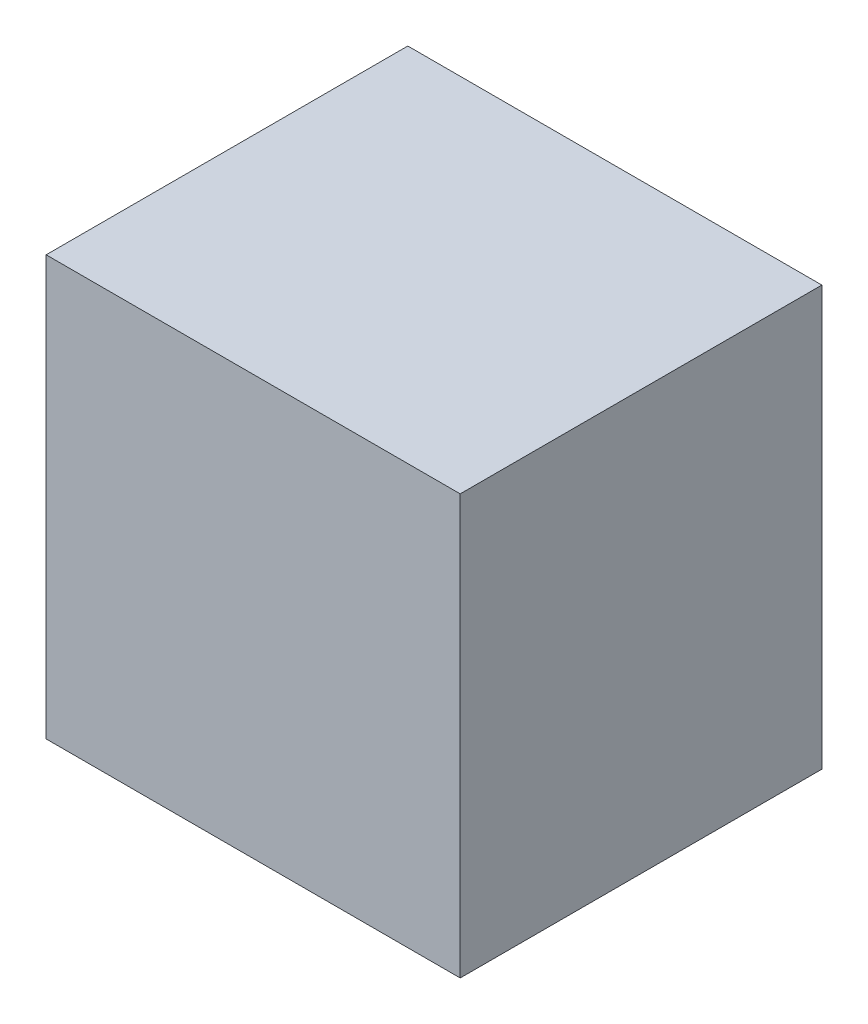
ISO-10303-21;
HEADER;
FILE_DESCRIPTION(('STEP AP214'),'2;1');
FILE_NAME('part.step','',(''),(''),'','','');
FILE_SCHEMA(('AUTOMOTIVE_DESIGN { 1 0 10303 214 1 1 1 1 }'));
ENDSEC;
DATA;
#1=APPLICATION_CONTEXT('core data for automotive mechanical design processes');
#2=APPLICATION_PROTOCOL_DEFINITION('international standard','automotive_design',2000,#1);
#3=PRODUCT_CONTEXT('',#1,'mechanical');
#4=PRODUCT('Part','Part','',(#3));
#5=PRODUCT_RELATED_PRODUCT_CATEGORY('part','',(#4));
#6=PRODUCT_DEFINITION_FORMATION('','',#4);
#7=PRODUCT_DEFINITION_CONTEXT('part definition',#1,'design');
#8=PRODUCT_DEFINITION('design','',#6,#7);
#9=PRODUCT_DEFINITION_SHAPE('','',#8);
#10=(LENGTH_UNIT() NAMED_UNIT(*) SI_UNIT(.MILLI.,.METRE.));
#11=(NAMED_UNIT(*) PLANE_ANGLE_UNIT() SI_UNIT($,.RADIAN.));
#12=(NAMED_UNIT(*) SI_UNIT($,.STERADIAN.) SOLID_ANGLE_UNIT());
#13=UNCERTAINTY_MEASURE_WITH_UNIT(LENGTH_MEASURE(1.E-05),#10,'distance_accuracy_value','');
#14=(GEOMETRIC_REPRESENTATION_CONTEXT(3) GLOBAL_UNCERTAINTY_ASSIGNED_CONTEXT((#13)) GLOBAL_UNIT_ASSIGNED_CONTEXT((#10,
#11,#12)) REPRESENTATION_CONTEXT('',''));
#15=CARTESIAN_POINT('',(0.,0.,0.));
#16=DIRECTION('',(0.,0.,1.));
#17=DIRECTION('',(1.,0.,0.));
#18=AXIS2_PLACEMENT_3D('',#15,#16,#17);
#19=CARTESIAN_POINT('',(-3.95,8.,3.45));
#20=DIRECTION('',(1.,0.,0.));
#21=DIRECTION('',(0.,0.,-1.));
#22=AXIS2_PLACEMENT_3D('',#19,#20,#21);
#23=PLANE('',#22);
#24=DIRECTION('',(0.,0.,1.));
#25=VECTOR('',#24,1.);
#26=CARTESIAN_POINT('',(-3.95,0.,3.45));
#27=LINE('',#26,#25);
#28=CARTESIAN_POINT('',(-3.95,0.,-3.45));
#29=VERTEX_POINT('',#28);
#30=CARTESIAN_POINT('',(-3.95,0.,3.45));
#31=VERTEX_POINT('',#30);
#32=EDGE_CURVE('E95',#29,#31,#27,.T.);
#33=ORIENTED_EDGE('',*,*,#32,.T.);
#34=DIRECTION('',(0.,-1.,0.));
#35=VECTOR('',#34,1.);
#36=CARTESIAN_POINT('',(-3.95,8.,3.45));
#37=LINE('',#36,#35);
#38=CARTESIAN_POINT('',(-3.95,8.,3.45));
#39=VERTEX_POINT('',#38);
#40=EDGE_CURVE('E11',#39,#31,#37,.T.);
#41=ORIENTED_EDGE('',*,*,#40,.F.);
#42=DIRECTION('',(0.,0.,1.));
#43=VECTOR('',#42,1.);
#44=CARTESIAN_POINT('',(-3.95,8.,3.45));
#45=LINE('',#44,#43);
#46=CARTESIAN_POINT('',(-3.95,8.,-3.45));
#47=VERTEX_POINT('',#46);
#48=EDGE_CURVE('E83',#47,#39,#45,.T.);
#49=ORIENTED_EDGE('',*,*,#48,.F.);
#50=DIRECTION('',(0.,-1.,0.));
#51=VECTOR('',#50,1.);
#52=CARTESIAN_POINT('',(-3.95,8.,-3.45));
#53=LINE('',#52,#51);
#54=EDGE_CURVE('E91',#47,#29,#53,.T.);
#55=ORIENTED_EDGE('',*,*,#54,.T.);
#56=EDGE_LOOP('',(#33,#41,#49,#55));
#57=FACE_BOUND('',#56,.T.);
#58=ADVANCED_FACE('F32',(#57),#23,.F.);
#59=CARTESIAN_POINT('',(3.95,8.,3.45));
#60=DIRECTION('',(0.,0.,-1.));
#61=DIRECTION('',(-1.,0.,0.));
#62=AXIS2_PLACEMENT_3D('',#59,#60,#61);
#63=PLANE('',#62);
#64=DIRECTION('',(1.,0.,0.));
#65=VECTOR('',#64,1.);
#66=CARTESIAN_POINT('',(3.95,0.,3.45));
#67=LINE('',#66,#65);
#68=CARTESIAN_POINT('',(3.95,0.,3.45));
#69=VERTEX_POINT('',#68);
#70=EDGE_CURVE('E87',#31,#69,#67,.T.);
#71=ORIENTED_EDGE('',*,*,#70,.T.);
#72=DIRECTION('',(0.,-1.,0.));
#73=VECTOR('',#72,1.);
#74=CARTESIAN_POINT('',(3.95,8.,3.45));
#75=LINE('',#74,#73);
#76=CARTESIAN_POINT('',(3.95,8.,3.45));
#77=VERTEX_POINT('',#76);
#78=EDGE_CURVE('E40',#77,#69,#75,.T.);
#79=ORIENTED_EDGE('',*,*,#78,.F.);
#80=DIRECTION('',(1.,0.,0.));
#81=VECTOR('',#80,1.);
#82=CARTESIAN_POINT('',(3.95,8.,3.45));
#83=LINE('',#82,#81);
#84=EDGE_CURVE('E78',#39,#77,#83,.T.);
#85=ORIENTED_EDGE('',*,*,#84,.F.);
#86=ORIENTED_EDGE('',*,*,#40,.T.);
#87=EDGE_LOOP('',(#71,#79,#85,#86));
#88=FACE_BOUND('',#87,.T.);
#89=ADVANCED_FACE('F86',(#88),#63,.F.);
#90=CARTESIAN_POINT('',(3.95,8.,3.45));
#91=DIRECTION('',(-1.,0.,0.));
#92=DIRECTION('',(0.,0.,1.));
#93=AXIS2_PLACEMENT_3D('',#90,#91,#92);
#94=PLANE('',#93);
#95=DIRECTION('',(0.,0.,-1.));
#96=VECTOR('',#95,1.);
#97=CARTESIAN_POINT('',(3.95,0.,3.45));
#98=LINE('',#97,#96);
#99=CARTESIAN_POINT('',(3.95,0.,-3.45));
#100=VERTEX_POINT('',#99);
#101=EDGE_CURVE('E65',#69,#100,#98,.T.);
#102=ORIENTED_EDGE('',*,*,#101,.T.);
#103=DIRECTION('',(0.,-1.,0.));
#104=VECTOR('',#103,1.);
#105=CARTESIAN_POINT('',(3.95,8.,-3.45));
#106=LINE('',#105,#104);
#107=CARTESIAN_POINT('',(3.95,8.,-3.45));
#108=VERTEX_POINT('',#107);
#109=EDGE_CURVE('E88',#108,#100,#106,.T.);
#110=ORIENTED_EDGE('',*,*,#109,.F.);
#111=DIRECTION('',(0.,0.,-1.));
#112=VECTOR('',#111,1.);
#113=CARTESIAN_POINT('',(3.95,8.,3.45));
#114=LINE('',#113,#112);
#115=EDGE_CURVE('E81',#77,#108,#114,.T.);
#116=ORIENTED_EDGE('',*,*,#115,.F.);
#117=ORIENTED_EDGE('',*,*,#78,.T.);
#118=EDGE_LOOP('',(#102,#110,#116,#117));
#119=FACE_BOUND('',#118,.T.);
#120=ADVANCED_FACE('F89',(#119),#94,.F.);
#121=CARTESIAN_POINT('',(3.95,8.,-3.45));
#122=DIRECTION('',(0.,0.,1.));
#123=DIRECTION('',(1.,0.,0.));
#124=AXIS2_PLACEMENT_3D('',#121,#122,#123);
#125=PLANE('',#124);
#126=DIRECTION('',(-1.,0.,0.));
#127=VECTOR('',#126,1.);
#128=CARTESIAN_POINT('',(3.95,0.,-3.45));
#129=LINE('',#128,#127);
#130=EDGE_CURVE('E71',#100,#29,#129,.T.);
#131=ORIENTED_EDGE('',*,*,#130,.T.);
#132=ORIENTED_EDGE('',*,*,#54,.F.);
#133=DIRECTION('',(-1.,0.,0.));
#134=VECTOR('',#133,1.);
#135=CARTESIAN_POINT('',(3.95,8.,-3.45));
#136=LINE('',#135,#134);
#137=EDGE_CURVE('E48',#108,#47,#136,.T.);
#138=ORIENTED_EDGE('',*,*,#137,.F.);
#139=ORIENTED_EDGE('',*,*,#109,.T.);
#140=EDGE_LOOP('',(#131,#132,#138,#139));
#141=FACE_BOUND('',#140,.T.);
#142=ADVANCED_FACE('F102',(#141),#125,.F.);
#143=CARTESIAN_POINT('',(0.,8.,0.));
#144=DIRECTION('',(0.,1.,0.));
#145=DIRECTION('',(0.,0.,1.));
#146=AXIS2_PLACEMENT_3D('',#143,#144,#145);
#147=PLANE('',#146);
#148=ORIENTED_EDGE('',*,*,#48,.T.);
#149=ORIENTED_EDGE('',*,*,#84,.T.);
#150=ORIENTED_EDGE('',*,*,#115,.T.);
#151=ORIENTED_EDGE('',*,*,#137,.T.);
#152=EDGE_LOOP('',(#148,#149,#150,#151));
#153=FACE_BOUND('',#152,.T.);
#154=ADVANCED_FACE('F79',(#153),#147,.T.);
#155=CARTESIAN_POINT('',(0.,0.,0.));
#156=DIRECTION('',(0.,1.,0.));
#157=DIRECTION('',(0.,0.,1.));
#158=AXIS2_PLACEMENT_3D('',#155,#156,#157);
#159=PLANE('',#158);
#160=ORIENTED_EDGE('',*,*,#32,.F.);
#161=ORIENTED_EDGE('',*,*,#130,.F.);
#162=ORIENTED_EDGE('',*,*,#101,.F.);
#163=ORIENTED_EDGE('',*,*,#70,.F.);
#164=EDGE_LOOP('',(#160,#161,#162,#163));
#165=FACE_BOUND('',#164,.T.);
#166=ADVANCED_FACE('F105',(#165),#159,.F.);
#167=CLOSED_SHELL('',(#58,#89,#120,#142,#154,#166));
#168=MANIFOLD_SOLID_BREP('B2',#167);
#169=ADVANCED_BREP_SHAPE_REPRESENTATION('',(#18,#168),#14);
#170=SHAPE_DEFINITION_REPRESENTATION(#9,#169);
ENDSEC;
END-ISO-10303-21;
